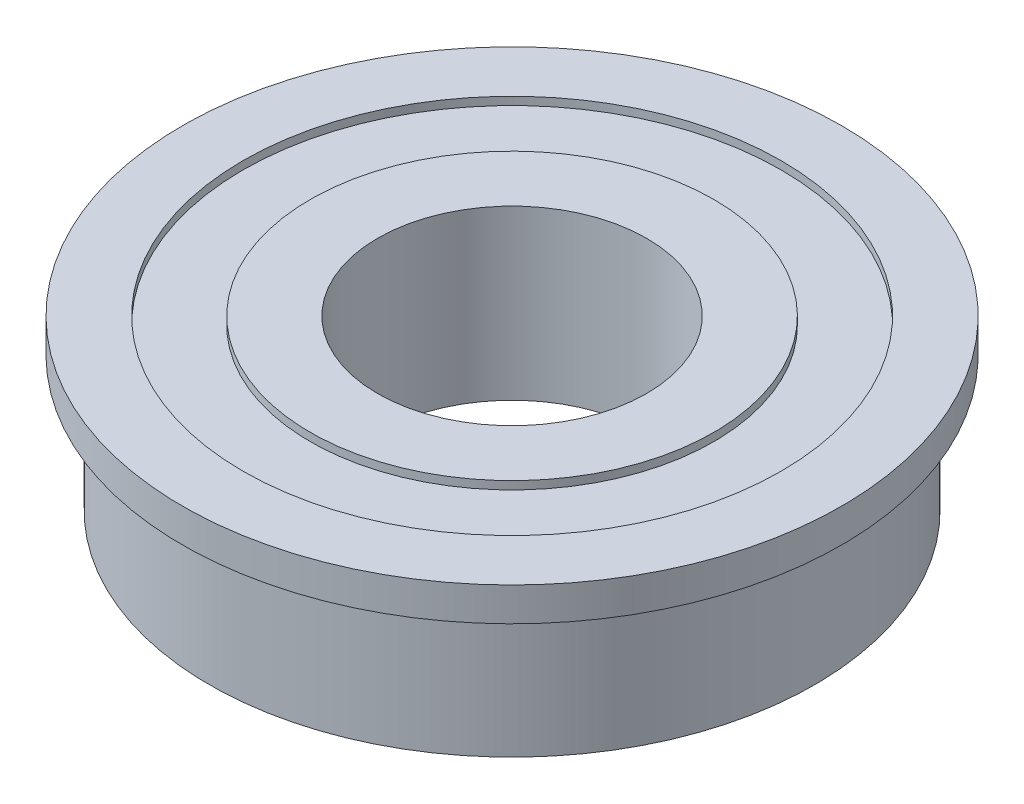
ISO-10303-21;
HEADER;
FILE_DESCRIPTION(('STEP AP214'),'2;1');
FILE_NAME('part.step','',(''),(''),'','','');
FILE_SCHEMA(('AUTOMOTIVE_DESIGN { 1 0 10303 214 1 1 1 1 }'));
ENDSEC;
DATA;
#1=APPLICATION_CONTEXT('core data for automotive mechanical design processes');
#2=APPLICATION_PROTOCOL_DEFINITION('international standard','automotive_design',2000,#1);
#3=PRODUCT_CONTEXT('',#1,'mechanical');
#4=PRODUCT('Part','Part','',(#3));
#5=PRODUCT_RELATED_PRODUCT_CATEGORY('part','',(#4));
#6=PRODUCT_DEFINITION_FORMATION('','',#4);
#7=PRODUCT_DEFINITION_CONTEXT('part definition',#1,'design');
#8=PRODUCT_DEFINITION('design','',#6,#7);
#9=PRODUCT_DEFINITION_SHAPE('','',#8);
#10=(LENGTH_UNIT() NAMED_UNIT(*) SI_UNIT(.MILLI.,.METRE.));
#11=(NAMED_UNIT(*) PLANE_ANGLE_UNIT() SI_UNIT($,.RADIAN.));
#12=(NAMED_UNIT(*) SI_UNIT($,.STERADIAN.) SOLID_ANGLE_UNIT());
#13=UNCERTAINTY_MEASURE_WITH_UNIT(LENGTH_MEASURE(1.E-05),#10,'distance_accuracy_value','');
#14=(GEOMETRIC_REPRESENTATION_CONTEXT(3) GLOBAL_UNCERTAINTY_ASSIGNED_CONTEXT((#13)) GLOBAL_UNIT_ASSIGNED_CONTEXT((#10,
#11,#12)) REPRESENTATION_CONTEXT('',''));
#15=CARTESIAN_POINT('',(0.,0.,0.));
#16=DIRECTION('',(0.,0.,1.));
#17=DIRECTION('',(1.,0.,0.));
#18=AXIS2_PLACEMENT_3D('',#15,#16,#17);
#19=CARTESIAN_POINT('',(0.,0.,0.));
#20=DIRECTION('',(0.,1.,0.));
#21=DIRECTION('',(0.,0.,-1.));
#22=AXIS2_PLACEMENT_3D('',#19,#20,#21);
#23=CYLINDRICAL_SURFACE('',#22,12.7);
#24=CARTESIAN_POINT('',(0.,7.9375,0.));
#25=DIRECTION('',(0.,-1.,0.));
#26=DIRECTION('',(0.,0.,-1.));
#27=AXIS2_PLACEMENT_3D('',#24,#25,#26);
#28=CIRCLE('',#27,12.7);
#29=CARTESIAN_POINT('',(0.,7.9375,-12.7));
#30=VERTEX_POINT('',#29);
#31=EDGE_CURVE('E66',#30,#30,#28,.F.);
#32=ORIENTED_EDGE('',*,*,#31,.T.);
#33=EDGE_LOOP('',(#32));
#34=FACE_BOUND('',#33,.T.);
#35=CARTESIAN_POINT('',(0.,7.5565,0.));
#36=DIRECTION('',(0.,-1.,0.));
#37=DIRECTION('',(0.,0.,-1.));
#38=AXIS2_PLACEMENT_3D('',#35,#36,#37);
#39=CIRCLE('',#38,12.7);
#40=CARTESIAN_POINT('',(0.,7.5565,-12.7));
#41=VERTEX_POINT('',#40);
#42=EDGE_CURVE('E38',#41,#41,#39,.T.);
#43=ORIENTED_EDGE('',*,*,#42,.T.);
#44=EDGE_LOOP('',(#43));
#45=FACE_BOUND('',#44,.T.);
#46=ADVANCED_FACE('F35',(#34,#45),#23,.F.);
#47=CARTESIAN_POINT('',(9.525,7.5565,0.));
#48=DIRECTION('',(0.,1.,0.));
#49=DIRECTION('',(0.,0.,-1.));
#50=AXIS2_PLACEMENT_3D('',#47,#48,#49);
#51=PLANE('',#50);
#52=CARTESIAN_POINT('',(0.,7.5565,0.));
#53=DIRECTION('',(0.,-1.,0.));
#54=DIRECTION('',(0.,0.,-1.));
#55=AXIS2_PLACEMENT_3D('',#52,#53,#54);
#56=CIRCLE('',#55,9.525);
#57=CARTESIAN_POINT('',(0.,7.5565,-9.525));
#58=VERTEX_POINT('',#57);
#59=EDGE_CURVE('E64',#58,#58,#56,.T.);
#60=ORIENTED_EDGE('',*,*,#59,.T.);
#61=EDGE_LOOP('',(#60));
#62=FACE_BOUND('',#61,.T.);
#63=ORIENTED_EDGE('',*,*,#42,.F.);
#64=EDGE_LOOP('',(#63));
#65=FACE_BOUND('',#64,.T.);
#66=ADVANCED_FACE('F74',(#62,#65),#51,.T.);
#67=CARTESIAN_POINT('',(12.7,7.9375,0.));
#68=DIRECTION('',(0.,1.,0.));
#69=DIRECTION('',(0.,0.,-1.));
#70=AXIS2_PLACEMENT_3D('',#67,#68,#69);
#71=PLANE('',#70);
#72=ORIENTED_EDGE('',*,*,#31,.F.);
#73=EDGE_LOOP('',(#72));
#74=FACE_BOUND('',#73,.T.);
#75=CARTESIAN_POINT('',(0.,7.9375,0.));
#76=DIRECTION('',(0.,-1.,0.));
#77=DIRECTION('',(0.,0.,-1.));
#78=AXIS2_PLACEMENT_3D('',#75,#76,#77);
#79=CIRCLE('',#78,15.5575);
#80=CARTESIAN_POINT('',(0.,7.9375,-15.5575));
#81=VERTEX_POINT('',#80);
#82=EDGE_CURVE('E61',#81,#81,#79,.F.);
#83=ORIENTED_EDGE('',*,*,#82,.T.);
#84=EDGE_LOOP('',(#83));
#85=FACE_BOUND('',#84,.T.);
#86=ADVANCED_FACE('F76',(#74,#85),#71,.T.);
#87=CARTESIAN_POINT('',(0.,0.,0.));
#88=DIRECTION('',(0.,1.,0.));
#89=DIRECTION('',(0.,0.,-1.));
#90=AXIS2_PLACEMENT_3D('',#87,#88,#89);
#91=CYLINDRICAL_SURFACE('',#90,9.525);
#92=ORIENTED_EDGE('',*,*,#59,.F.);
#93=EDGE_LOOP('',(#92));
#94=FACE_BOUND('',#93,.T.);
#95=CARTESIAN_POINT('',(0.,7.9375,0.));
#96=DIRECTION('',(0.,-1.,0.));
#97=DIRECTION('',(0.,0.,-1.));
#98=AXIS2_PLACEMENT_3D('',#95,#96,#97);
#99=CIRCLE('',#98,9.525);
#100=CARTESIAN_POINT('',(0.,7.9375,-9.525));
#101=VERTEX_POINT('',#100);
#102=EDGE_CURVE('E58',#101,#101,#99,.T.);
#103=ORIENTED_EDGE('',*,*,#102,.T.);
#104=EDGE_LOOP('',(#103));
#105=FACE_BOUND('',#104,.T.);
#106=ADVANCED_FACE('F82',(#94,#105),#91,.T.);
#107=CARTESIAN_POINT('',(0.,0.,0.));
#108=DIRECTION('',(0.,1.,0.));
#109=DIRECTION('',(0.,0.,-1.));
#110=AXIS2_PLACEMENT_3D('',#107,#108,#109);
#111=CYLINDRICAL_SURFACE('',#110,15.5575);
#112=CARTESIAN_POINT('',(0.,6.35,0.));
#113=DIRECTION('',(0.,-1.,0.));
#114=DIRECTION('',(0.,0.,-1.));
#115=AXIS2_PLACEMENT_3D('',#112,#113,#114);
#116=CIRCLE('',#115,15.5575);
#117=CARTESIAN_POINT('',(0.,6.35,-15.5575));
#118=VERTEX_POINT('',#117);
#119=EDGE_CURVE('E55',#118,#118,#116,.F.);
#120=ORIENTED_EDGE('',*,*,#119,.T.);
#121=EDGE_LOOP('',(#120));
#122=FACE_BOUND('',#121,.T.);
#123=ORIENTED_EDGE('',*,*,#82,.F.);
#124=EDGE_LOOP('',(#123));
#125=FACE_BOUND('',#124,.T.);
#126=ADVANCED_FACE('F88',(#122,#125),#111,.T.);
#127=CARTESIAN_POINT('',(6.35,7.9375,0.));
#128=DIRECTION('',(0.,1.,0.));
#129=DIRECTION('',(0.,0.,-1.));
#130=AXIS2_PLACEMENT_3D('',#127,#128,#129);
#131=PLANE('',#130);
#132=CARTESIAN_POINT('',(0.,7.9375,0.));
#133=DIRECTION('',(0.,-1.,0.));
#134=DIRECTION('',(0.,0.,-1.));
#135=AXIS2_PLACEMENT_3D('',#132,#133,#134);
#136=CIRCLE('',#135,6.35);
#137=CARTESIAN_POINT('',(0.,7.9375,-6.35));
#138=VERTEX_POINT('',#137);
#139=EDGE_CURVE('E52',#138,#138,#136,.F.);
#140=ORIENTED_EDGE('',*,*,#139,.F.);
#141=EDGE_LOOP('',(#140));
#142=FACE_BOUND('',#141,.T.);
#143=ORIENTED_EDGE('',*,*,#102,.F.);
#144=EDGE_LOOP('',(#143));
#145=FACE_BOUND('',#144,.T.);
#146=ADVANCED_FACE('F92',(#142,#145),#131,.T.);
#147=CARTESIAN_POINT('',(15.5575,6.35,0.));
#148=DIRECTION('',(0.,-1.,0.));
#149=DIRECTION('',(0.,0.,1.));
#150=AXIS2_PLACEMENT_3D('',#147,#148,#149);
#151=PLANE('',#150);
#152=ORIENTED_EDGE('',*,*,#119,.F.);
#153=EDGE_LOOP('',(#152));
#154=FACE_BOUND('',#153,.T.);
#155=CARTESIAN_POINT('',(0.,6.35,0.));
#156=DIRECTION('',(0.,-1.,0.));
#157=DIRECTION('',(0.,0.,-1.));
#158=AXIS2_PLACEMENT_3D('',#155,#156,#157);
#159=CIRCLE('',#158,14.2875);
#160=CARTESIAN_POINT('',(0.,6.35,-14.2875));
#161=VERTEX_POINT('',#160);
#162=EDGE_CURVE('E47',#161,#161,#159,.F.);
#163=ORIENTED_EDGE('',*,*,#162,.T.);
#164=EDGE_LOOP('',(#163));
#165=FACE_BOUND('',#164,.T.);
#166=ADVANCED_FACE('F96',(#154,#165),#151,.T.);
#167=CARTESIAN_POINT('',(0.,0.,0.));
#168=DIRECTION('',(0.,1.,0.));
#169=DIRECTION('',(0.,0.,-1.));
#170=AXIS2_PLACEMENT_3D('',#167,#168,#169);
#171=CYLINDRICAL_SURFACE('',#170,6.35);
#172=ORIENTED_EDGE('',*,*,#139,.T.);
#173=EDGE_LOOP('',(#172));
#174=FACE_BOUND('',#173,.T.);
#175=CARTESIAN_POINT('',(0.,0.,0.));
#176=DIRECTION('',(0.,-1.,0.));
#177=DIRECTION('',(0.,0.,-1.));
#178=AXIS2_PLACEMENT_3D('',#175,#176,#177);
#179=CIRCLE('',#178,6.35);
#180=CARTESIAN_POINT('',(0.,0.,-6.35));
#181=VERTEX_POINT('',#180);
#182=EDGE_CURVE('E42',#181,#181,#179,.T.);
#183=ORIENTED_EDGE('',*,*,#182,.T.);
#184=EDGE_LOOP('',(#183));
#185=FACE_BOUND('',#184,.T.);
#186=ADVANCED_FACE('F100',(#174,#185),#171,.F.);
#187=CARTESIAN_POINT('',(0.,0.,0.));
#188=DIRECTION('',(0.,1.,0.));
#189=DIRECTION('',(0.,0.,-1.));
#190=AXIS2_PLACEMENT_3D('',#187,#188,#189);
#191=CYLINDRICAL_SURFACE('',#190,14.2875);
#192=CARTESIAN_POINT('',(0.,0.,0.));
#193=DIRECTION('',(0.,-1.,0.));
#194=DIRECTION('',(0.,0.,-1.));
#195=AXIS2_PLACEMENT_3D('',#192,#193,#194);
#196=CIRCLE('',#195,14.2875);
#197=CARTESIAN_POINT('',(0.,0.,-14.2875));
#198=VERTEX_POINT('',#197);
#199=EDGE_CURVE('E10',#198,#198,#196,.F.);
#200=ORIENTED_EDGE('',*,*,#199,.T.);
#201=EDGE_LOOP('',(#200));
#202=FACE_BOUND('',#201,.T.);
#203=ORIENTED_EDGE('',*,*,#162,.F.);
#204=EDGE_LOOP('',(#203));
#205=FACE_BOUND('',#204,.T.);
#206=ADVANCED_FACE('F104',(#202,#205),#191,.T.);
#207=CARTESIAN_POINT('',(14.2875,0.,0.));
#208=DIRECTION('',(0.,-1.,0.));
#209=DIRECTION('',(0.,0.,1.));
#210=AXIS2_PLACEMENT_3D('',#207,#208,#209);
#211=PLANE('',#210);
#212=ORIENTED_EDGE('',*,*,#199,.F.);
#213=EDGE_LOOP('',(#212));
#214=FACE_BOUND('',#213,.T.);
#215=ORIENTED_EDGE('',*,*,#182,.F.);
#216=EDGE_LOOP('',(#215));
#217=FACE_BOUND('',#216,.T.);
#218=ADVANCED_FACE('F108',(#214,#217),#211,.T.);
#219=CLOSED_SHELL('',(#46,#66,#86,#106,#126,#146,#166,#186,#206,#218));
#220=MANIFOLD_SOLID_BREP('B2',#219);
#221=ADVANCED_BREP_SHAPE_REPRESENTATION('',(#18,#220),#14);
#222=SHAPE_DEFINITION_REPRESENTATION(#9,#221);
ENDSEC;
END-ISO-10303-21;
